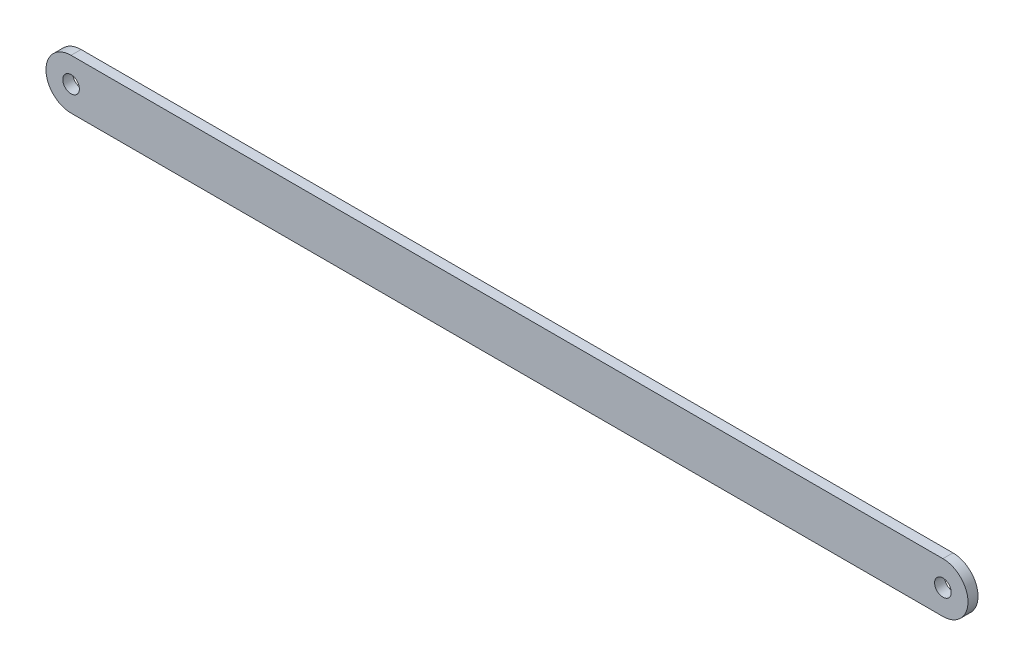
ISO-10303-21;
HEADER;
FILE_DESCRIPTION(('STEP AP214'),'2;1');
FILE_NAME('part.step','',(''),(''),'','','');
FILE_SCHEMA(('AUTOMOTIVE_DESIGN { 1 0 10303 214 1 1 1 1 }'));
ENDSEC;
DATA;
#1=APPLICATION_CONTEXT('core data for automotive mechanical design processes');
#2=APPLICATION_PROTOCOL_DEFINITION('international standard','automotive_design',2000,#1);
#3=PRODUCT_CONTEXT('',#1,'mechanical');
#4=PRODUCT('Part','Part','',(#3));
#5=PRODUCT_RELATED_PRODUCT_CATEGORY('part','',(#4));
#6=PRODUCT_DEFINITION_FORMATION('','',#4);
#7=PRODUCT_DEFINITION_CONTEXT('part definition',#1,'design');
#8=PRODUCT_DEFINITION('design','',#6,#7);
#9=PRODUCT_DEFINITION_SHAPE('','',#8);
#10=(LENGTH_UNIT() NAMED_UNIT(*) SI_UNIT(.MILLI.,.METRE.));
#11=(NAMED_UNIT(*) PLANE_ANGLE_UNIT() SI_UNIT($,.RADIAN.));
#12=(NAMED_UNIT(*) SI_UNIT($,.STERADIAN.) SOLID_ANGLE_UNIT());
#13=UNCERTAINTY_MEASURE_WITH_UNIT(LENGTH_MEASURE(1.E-05),#10,'distance_accuracy_value','');
#14=(GEOMETRIC_REPRESENTATION_CONTEXT(3) GLOBAL_UNCERTAINTY_ASSIGNED_CONTEXT((#13)) GLOBAL_UNIT_ASSIGNED_CONTEXT((#10,
#11,#12)) REPRESENTATION_CONTEXT('',''));
#15=CARTESIAN_POINT('',(0.,0.,0.));
#16=DIRECTION('',(0.,0.,1.));
#17=DIRECTION('',(1.,0.,0.));
#18=AXIS2_PLACEMENT_3D('',#15,#16,#17);
#19=CARTESIAN_POINT('',(0.,0.,5.));
#20=DIRECTION('',(0.,0.,1.));
#21=DIRECTION('',(1.,0.,0.));
#22=AXIS2_PLACEMENT_3D('',#19,#20,#21);
#23=PLANE('',#22);
#24=CARTESIAN_POINT('',(0.,0.,5.));
#25=DIRECTION('',(0.,0.,1.));
#26=DIRECTION('',(1.,0.,0.));
#27=AXIS2_PLACEMENT_3D('',#24,#25,#26);
#28=CIRCLE('',#27,4.15);
#29=CARTESIAN_POINT('',(4.15,0.,5.));
#30=VERTEX_POINT('',#29);
#31=EDGE_CURVE('E100',#30,#30,#28,.T.);
#32=ORIENTED_EDGE('',*,*,#31,.F.);
#33=EDGE_LOOP('',(#32));
#34=FACE_BOUND('',#33,.T.);
#35=CARTESIAN_POINT('',(0.,0.,5.));
#36=DIRECTION('',(0.,0.,1.));
#37=DIRECTION('',(1.,0.,0.));
#38=AXIS2_PLACEMENT_3D('',#35,#36,#37);
#39=CIRCLE('',#38,12.5);
#40=CARTESIAN_POINT('',(0.,12.5,5.));
#41=VERTEX_POINT('',#40);
#42=CARTESIAN_POINT('',(0.,-12.5,5.));
#43=VERTEX_POINT('',#42);
#44=EDGE_CURVE('E85',#41,#43,#39,.T.);
#45=ORIENTED_EDGE('',*,*,#44,.T.);
#46=DIRECTION('',(1.,0.,0.));
#47=VECTOR('',#46,1.);
#48=CARTESIAN_POINT('',(0.,-12.5,5.));
#49=LINE('',#48,#47);
#50=CARTESIAN_POINT('',(435.,-12.5,5.));
#51=VERTEX_POINT('',#50);
#52=EDGE_CURVE('E80',#43,#51,#49,.T.);
#53=ORIENTED_EDGE('',*,*,#52,.T.);
#54=CARTESIAN_POINT('',(435.,0.,5.));
#55=DIRECTION('',(0.,0.,1.));
#56=DIRECTION('',(-1.,0.,0.));
#57=AXIS2_PLACEMENT_3D('',#54,#55,#56);
#58=CIRCLE('',#57,12.5);
#59=CARTESIAN_POINT('',(435.,12.5,5.));
#60=VERTEX_POINT('',#59);
#61=EDGE_CURVE('E83',#51,#60,#58,.T.);
#62=ORIENTED_EDGE('',*,*,#61,.T.);
#63=DIRECTION('',(-1.,0.,0.));
#64=VECTOR('',#63,1.);
#65=CARTESIAN_POINT('',(0.,12.5,5.));
#66=LINE('',#65,#64);
#67=EDGE_CURVE('E50',#60,#41,#66,.T.);
#68=ORIENTED_EDGE('',*,*,#67,.T.);
#69=EDGE_LOOP('',(#45,#53,#62,#68));
#70=FACE_BOUND('',#69,.T.);
#71=CARTESIAN_POINT('',(435.,0.,5.));
#72=DIRECTION('',(0.,0.,1.));
#73=DIRECTION('',(1.,0.,0.));
#74=AXIS2_PLACEMENT_3D('',#71,#72,#73);
#75=CIRCLE('',#74,4.15000000000001);
#76=CARTESIAN_POINT('',(439.15,0.,5.));
#77=VERTEX_POINT('',#76);
#78=EDGE_CURVE('E115',#77,#77,#75,.T.);
#79=ORIENTED_EDGE('',*,*,#78,.F.);
#80=EDGE_LOOP('',(#79));
#81=FACE_BOUND('',#80,.T.);
#82=ADVANCED_FACE('F33',(#34,#70,#81),#23,.T.);
#83=CARTESIAN_POINT('',(0.,0.,0.));
#84=DIRECTION('',(0.,0.,1.));
#85=DIRECTION('',(1.,0.,0.));
#86=AXIS2_PLACEMENT_3D('',#83,#84,#85);
#87=PLANE('',#86);
#88=CARTESIAN_POINT('',(0.,0.,0.));
#89=DIRECTION('',(0.,0.,1.));
#90=DIRECTION('',(1.,0.,0.));
#91=AXIS2_PLACEMENT_3D('',#88,#89,#90);
#92=CIRCLE('',#91,4.15);
#93=CARTESIAN_POINT('',(4.15,0.,0.));
#94=VERTEX_POINT('',#93);
#95=EDGE_CURVE('E112',#94,#94,#92,.T.);
#96=ORIENTED_EDGE('',*,*,#95,.T.);
#97=EDGE_LOOP('',(#96));
#98=FACE_BOUND('',#97,.T.);
#99=CARTESIAN_POINT('',(0.,0.,0.));
#100=DIRECTION('',(0.,0.,1.));
#101=DIRECTION('',(1.,0.,0.));
#102=AXIS2_PLACEMENT_3D('',#99,#100,#101);
#103=CIRCLE('',#102,12.5);
#104=CARTESIAN_POINT('',(0.,12.5,0.));
#105=VERTEX_POINT('',#104);
#106=CARTESIAN_POINT('',(0.,-12.5,0.));
#107=VERTEX_POINT('',#106);
#108=EDGE_CURVE('E97',#105,#107,#103,.T.);
#109=ORIENTED_EDGE('',*,*,#108,.F.);
#110=DIRECTION('',(-1.,0.,0.));
#111=VECTOR('',#110,1.);
#112=CARTESIAN_POINT('',(0.,12.5,0.));
#113=LINE('',#112,#111);
#114=CARTESIAN_POINT('',(435.,12.5,0.));
#115=VERTEX_POINT('',#114);
#116=EDGE_CURVE('E73',#115,#105,#113,.T.);
#117=ORIENTED_EDGE('',*,*,#116,.F.);
#118=CARTESIAN_POINT('',(435.,0.,0.));
#119=DIRECTION('',(0.,0.,1.));
#120=DIRECTION('',(-1.,0.,0.));
#121=AXIS2_PLACEMENT_3D('',#118,#119,#120);
#122=CIRCLE('',#121,12.5);
#123=CARTESIAN_POINT('',(435.,-12.5,0.));
#124=VERTEX_POINT('',#123);
#125=EDGE_CURVE('E67',#124,#115,#122,.T.);
#126=ORIENTED_EDGE('',*,*,#125,.F.);
#127=DIRECTION('',(1.,0.,0.));
#128=VECTOR('',#127,1.);
#129=CARTESIAN_POINT('',(0.,-12.5,0.));
#130=LINE('',#129,#128);
#131=EDGE_CURVE('E89',#107,#124,#130,.T.);
#132=ORIENTED_EDGE('',*,*,#131,.F.);
#133=EDGE_LOOP('',(#109,#117,#126,#132));
#134=FACE_BOUND('',#133,.T.);
#135=CARTESIAN_POINT('',(435.,0.,0.));
#136=DIRECTION('',(0.,0.,1.));
#137=DIRECTION('',(1.,0.,0.));
#138=AXIS2_PLACEMENT_3D('',#135,#136,#137);
#139=CIRCLE('',#138,4.15000000000001);
#140=CARTESIAN_POINT('',(439.15,0.,0.));
#141=VERTEX_POINT('',#140);
#142=EDGE_CURVE('E118',#141,#141,#139,.T.);
#143=ORIENTED_EDGE('',*,*,#142,.T.);
#144=EDGE_LOOP('',(#143));
#145=FACE_BOUND('',#144,.T.);
#146=ADVANCED_FACE('F108',(#98,#134,#145),#87,.F.);
#147=CARTESIAN_POINT('',(0.,0.,5.));
#148=DIRECTION('',(0.,0.,-1.));
#149=DIRECTION('',(-1.,0.,0.));
#150=AXIS2_PLACEMENT_3D('',#147,#148,#149);
#151=CYLINDRICAL_SURFACE('',#150,12.5);
#152=ORIENTED_EDGE('',*,*,#108,.T.);
#153=DIRECTION('',(0.,0.,-1.));
#154=VECTOR('',#153,1.);
#155=CARTESIAN_POINT('',(0.,-12.5,5.));
#156=LINE('',#155,#154);
#157=EDGE_CURVE('E11',#43,#107,#156,.T.);
#158=ORIENTED_EDGE('',*,*,#157,.F.);
#159=ORIENTED_EDGE('',*,*,#44,.F.);
#160=DIRECTION('',(0.,0.,-1.));
#161=VECTOR('',#160,1.);
#162=CARTESIAN_POINT('',(0.,12.5,5.));
#163=LINE('',#162,#161);
#164=EDGE_CURVE('E93',#41,#105,#163,.T.);
#165=ORIENTED_EDGE('',*,*,#164,.T.);
#166=EDGE_LOOP('',(#152,#158,#159,#165));
#167=FACE_BOUND('',#166,.T.);
#168=ADVANCED_FACE('F35',(#167),#151,.T.);
#169=CARTESIAN_POINT('',(0.,-12.5,5.));
#170=DIRECTION('',(0.,1.,0.));
#171=DIRECTION('',(0.,0.,1.));
#172=AXIS2_PLACEMENT_3D('',#169,#170,#171);
#173=PLANE('',#172);
#174=ORIENTED_EDGE('',*,*,#131,.T.);
#175=DIRECTION('',(0.,0.,-1.));
#176=VECTOR('',#175,1.);
#177=CARTESIAN_POINT('',(435.,-12.5,5.));
#178=LINE('',#177,#176);
#179=EDGE_CURVE('E42',#51,#124,#178,.T.);
#180=ORIENTED_EDGE('',*,*,#179,.F.);
#181=ORIENTED_EDGE('',*,*,#52,.F.);
#182=ORIENTED_EDGE('',*,*,#157,.T.);
#183=EDGE_LOOP('',(#174,#180,#181,#182));
#184=FACE_BOUND('',#183,.T.);
#185=ADVANCED_FACE('F88',(#184),#173,.F.);
#186=CARTESIAN_POINT('',(435.,0.,5.));
#187=DIRECTION('',(0.,0.,-1.));
#188=DIRECTION('',(-1.,0.,0.));
#189=AXIS2_PLACEMENT_3D('',#186,#187,#188);
#190=CYLINDRICAL_SURFACE('',#189,12.5);
#191=ORIENTED_EDGE('',*,*,#125,.T.);
#192=DIRECTION('',(0.,0.,-1.));
#193=VECTOR('',#192,1.);
#194=CARTESIAN_POINT('',(435.,12.5,5.));
#195=LINE('',#194,#193);
#196=EDGE_CURVE('E90',#60,#115,#195,.T.);
#197=ORIENTED_EDGE('',*,*,#196,.F.);
#198=ORIENTED_EDGE('',*,*,#61,.F.);
#199=ORIENTED_EDGE('',*,*,#179,.T.);
#200=EDGE_LOOP('',(#191,#197,#198,#199));
#201=FACE_BOUND('',#200,.T.);
#202=ADVANCED_FACE('F91',(#201),#190,.T.);
#203=CARTESIAN_POINT('',(0.,12.5,5.));
#204=DIRECTION('',(0.,-1.,0.));
#205=DIRECTION('',(0.,0.,-1.));
#206=AXIS2_PLACEMENT_3D('',#203,#204,#205);
#207=PLANE('',#206);
#208=ORIENTED_EDGE('',*,*,#116,.T.);
#209=ORIENTED_EDGE('',*,*,#164,.F.);
#210=ORIENTED_EDGE('',*,*,#67,.F.);
#211=ORIENTED_EDGE('',*,*,#196,.T.);
#212=EDGE_LOOP('',(#208,#209,#210,#211));
#213=FACE_BOUND('',#212,.T.);
#214=ADVANCED_FACE('F105',(#213),#207,.F.);
#215=CARTESIAN_POINT('',(0.,0.,5.));
#216=DIRECTION('',(0.,0.,-1.));
#217=DIRECTION('',(-1.,0.,0.));
#218=AXIS2_PLACEMENT_3D('',#215,#216,#217);
#219=CYLINDRICAL_SURFACE('',#218,4.15);
#220=ORIENTED_EDGE('',*,*,#31,.T.);
#221=EDGE_LOOP('',(#220));
#222=FACE_BOUND('',#221,.T.);
#223=ORIENTED_EDGE('',*,*,#95,.F.);
#224=EDGE_LOOP('',(#223));
#225=FACE_BOUND('',#224,.T.);
#226=ADVANCED_FACE('F136',(#222,#225),#219,.F.);
#227=CARTESIAN_POINT('',(435.,0.,5.));
#228=DIRECTION('',(0.,0.,-1.));
#229=DIRECTION('',(-1.,0.,0.));
#230=AXIS2_PLACEMENT_3D('',#227,#228,#229);
#231=CYLINDRICAL_SURFACE('',#230,4.15000000000001);
#232=ORIENTED_EDGE('',*,*,#78,.T.);
#233=EDGE_LOOP('',(#232));
#234=FACE_BOUND('',#233,.T.);
#235=ORIENTED_EDGE('',*,*,#142,.F.);
#236=EDGE_LOOP('',(#235));
#237=FACE_BOUND('',#236,.T.);
#238=ADVANCED_FACE('F124',(#234,#237),#231,.F.);
#239=CLOSED_SHELL('',(#82,#146,#168,#185,#202,#214,#226,#238));
#240=MANIFOLD_SOLID_BREP('B2',#239);
#241=ADVANCED_BREP_SHAPE_REPRESENTATION('',(#18,#240),#14);
#242=SHAPE_DEFINITION_REPRESENTATION(#9,#241);
ENDSEC;
END-ISO-10303-21;
